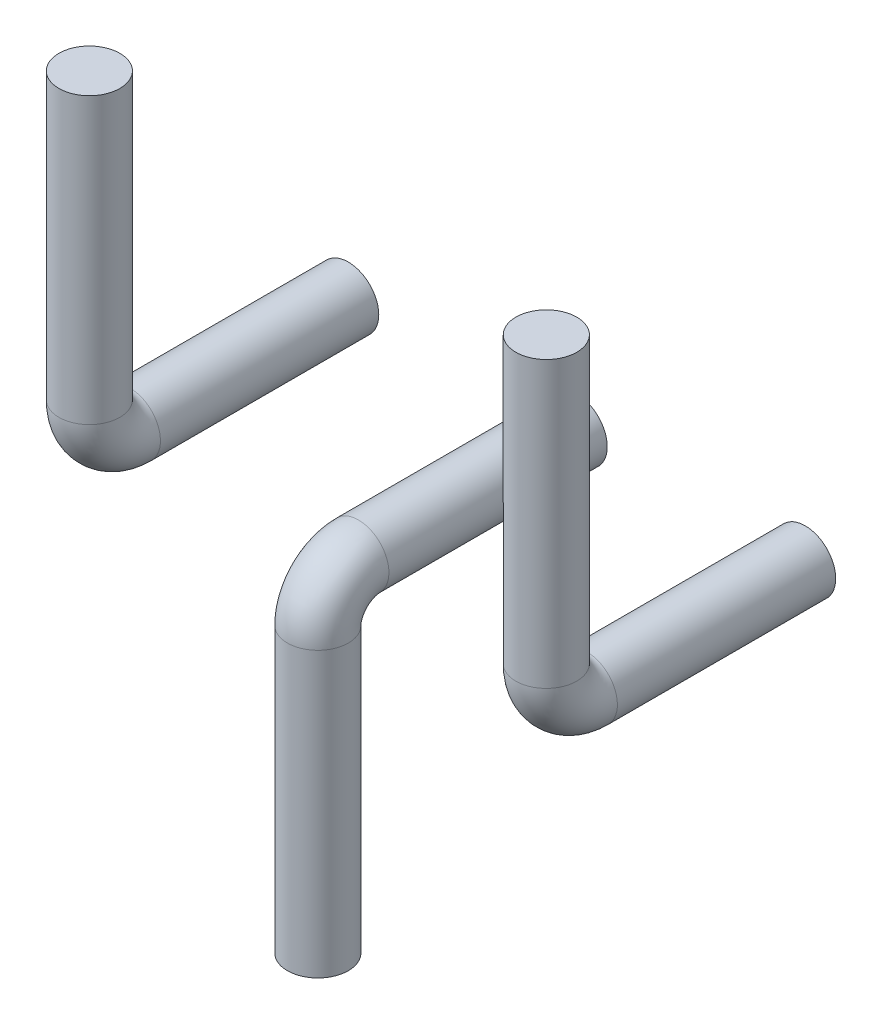
ISO-10303-21;
HEADER;
FILE_DESCRIPTION(('STEP AP214'),'2;1');
FILE_NAME('part.step','',(''),(''),'','','');
FILE_SCHEMA(('AUTOMOTIVE_DESIGN { 1 0 10303 214 1 1 1 1 }'));
ENDSEC;
DATA;
#1=APPLICATION_CONTEXT('core data for automotive mechanical design processes');
#2=APPLICATION_PROTOCOL_DEFINITION('international standard','automotive_design',2000,#1);
#3=PRODUCT_CONTEXT('',#1,'mechanical');
#4=PRODUCT('Part','Part','',(#3));
#5=PRODUCT_RELATED_PRODUCT_CATEGORY('part','',(#4));
#6=PRODUCT_DEFINITION_FORMATION('','',#4);
#7=PRODUCT_DEFINITION_CONTEXT('part definition',#1,'design');
#8=PRODUCT_DEFINITION('design','',#6,#7);
#9=PRODUCT_DEFINITION_SHAPE('','',#8);
#10=(LENGTH_UNIT() NAMED_UNIT(*) SI_UNIT(.MILLI.,.METRE.));
#11=(NAMED_UNIT(*) PLANE_ANGLE_UNIT() SI_UNIT($,.RADIAN.));
#12=(NAMED_UNIT(*) SI_UNIT($,.STERADIAN.) SOLID_ANGLE_UNIT());
#13=UNCERTAINTY_MEASURE_WITH_UNIT(LENGTH_MEASURE(1.E-05),#10,'distance_accuracy_value','');
#14=(GEOMETRIC_REPRESENTATION_CONTEXT(3) GLOBAL_UNCERTAINTY_ASSIGNED_CONTEXT((#13)) GLOBAL_UNIT_ASSIGNED_CONTEXT((#10,
#11,#12)) REPRESENTATION_CONTEXT('',''));
#15=CARTESIAN_POINT('',(0.,0.,0.));
#16=DIRECTION('',(0.,0.,1.));
#17=DIRECTION('',(1.,0.,0.));
#18=AXIS2_PLACEMENT_3D('',#15,#16,#17);
#19=CARTESIAN_POINT('',(-32.5000000000001,-32.,25.5));
#20=DIRECTION('',(0.,-1.,0.));
#21=DIRECTION('',(1.,0.,0.));
#22=AXIS2_PLACEMENT_3D('',#19,#20,#21);
#23=PLANE('',#22);
#24=CARTESIAN_POINT('',(-32.5000000000001,-32.,25.5));
#25=DIRECTION('',(0.,-1.,0.));
#26=DIRECTION('',(1.,0.,0.));
#27=AXIS2_PLACEMENT_3D('',#24,#25,#26);
#28=CIRCLE('',#27,3.);
#29=CARTESIAN_POINT('',(-29.5000000000001,-32.,25.5));
#30=VERTEX_POINT('',#29);
#31=EDGE_CURVE('E55',#30,#30,#28,.T.);
#32=ORIENTED_EDGE('',*,*,#31,.T.);
#33=EDGE_LOOP('',(#32));
#34=FACE_BOUND('',#33,.T.);
#35=ADVANCED_FACE('F41',(#34),#23,.T.);
#36=CARTESIAN_POINT('',(-32.5000000000001,-0.0508158360944468,0.));
#37=DIRECTION('',(0.,0.,1.));
#38=DIRECTION('',(1.,0.,0.));
#39=AXIS2_PLACEMENT_3D('',#36,#37,#38);
#40=PLANE('',#39);
#41=CARTESIAN_POINT('',(-32.5000000000001,-0.0508158360944468,0.));
#42=DIRECTION('',(0.,0.,1.));
#43=DIRECTION('',(1.,0.,0.));
#44=AXIS2_PLACEMENT_3D('',#41,#42,#43);
#45=CIRCLE('',#44,3.);
#46=CARTESIAN_POINT('',(-29.5000000000001,-0.0508158360944468,0.));
#47=VERTEX_POINT('',#46);
#48=EDGE_CURVE('E11',#47,#47,#45,.T.);
#49=ORIENTED_EDGE('',*,*,#48,.F.);
#50=EDGE_LOOP('',(#49));
#51=FACE_BOUND('',#50,.T.);
#52=ADVANCED_FACE('F65',(#51),#40,.F.);
#53=CARTESIAN_POINT('',(-32.5000000000001,-32.,25.5));
#54=DIRECTION('',(0.,1.,0.));
#55=DIRECTION('',(0.,0.,1.));
#56=AXIS2_PLACEMENT_3D('',#53,#54,#55);
#57=CYLINDRICAL_SURFACE('',#56,3.);
#58=CARTESIAN_POINT('',(-32.5000000000001,-4.05081583609447,25.5));
#59=DIRECTION('',(0.,-1.,0.));
#60=DIRECTION('',(1.,0.,0.));
#61=AXIS2_PLACEMENT_3D('',#58,#59,#60);
#62=CIRCLE('',#61,3.);
#63=CARTESIAN_POINT('',(-32.5000000000001,-4.0508158360945,28.5));
#64=VERTEX_POINT('',#63);
#65=EDGE_CURVE('E51',#64,#64,#62,.T.);
#66=ORIENTED_EDGE('',*,*,#65,.T.);
#67=EDGE_LOOP('',(#66));
#68=FACE_BOUND('',#67,.T.);
#69=ORIENTED_EDGE('',*,*,#31,.F.);
#70=EDGE_LOOP('',(#69));
#71=FACE_BOUND('',#70,.T.);
#72=ADVANCED_FACE('F62',(#68,#71),#57,.T.);
#73=CARTESIAN_POINT('',(-32.5000000000001,-4.05081583609445,21.5));
#74=DIRECTION('',(-1.,0.,0.));
#75=DIRECTION('',(0.,0.,1.));
#76=AXIS2_PLACEMENT_3D('',#73,#74,#75);
#77=TOROIDAL_SURFACE('',#76,4.,3.);
#78=CARTESIAN_POINT('',(-32.5000000000001,-0.0508158360944463,21.5));
#79=DIRECTION('',(0.,0.,1.));
#80=DIRECTION('',(1.,0.,0.));
#81=AXIS2_PLACEMENT_3D('',#78,#79,#80);
#82=CIRCLE('',#81,3.);
#83=CARTESIAN_POINT('',(-32.5000000000001,2.94918416390555,21.5));
#84=VERTEX_POINT('',#83);
#85=EDGE_CURVE('E47',#84,#84,#82,.T.);
#86=CARTESIAN_POINT('',(-32.5000000000001,-4.05081583609445,21.5));
#87=DIRECTION('',(-1.,0.,0.));
#88=DIRECTION('',(0.,0.,1.));
#89=AXIS2_PLACEMENT_3D('',#86,#87,#88);
#90=CIRCLE('',#89,7.);
#91=EDGE_CURVE('',#64,#84,#90,.T.);
#92=ORIENTED_EDGE('',*,*,#65,.F.);
#93=ORIENTED_EDGE('',*,*,#85,.T.);
#94=ORIENTED_EDGE('',*,*,#91,.T.);
#95=ORIENTED_EDGE('',*,*,#91,.F.);
#96=EDGE_LOOP('',(#92,#94,#93,#95));
#97=FACE_BOUND('',#96,.T.);
#98=ADVANCED_FACE('F64',(#97),#77,.T.);
#99=CARTESIAN_POINT('',(-32.5000000000001,-0.0508158360944468,21.5));
#100=DIRECTION('',(0.,0.,-1.));
#101=DIRECTION('',(-1.,0.,0.));
#102=AXIS2_PLACEMENT_3D('',#99,#100,#101);
#103=CYLINDRICAL_SURFACE('',#102,3.);
#104=ORIENTED_EDGE('',*,*,#48,.T.);
#105=EDGE_LOOP('',(#104));
#106=FACE_BOUND('',#105,.T.);
#107=ORIENTED_EDGE('',*,*,#85,.F.);
#108=EDGE_LOOP('',(#107));
#109=FACE_BOUND('',#108,.T.);
#110=ADVANCED_FACE('F72',(#106,#109),#103,.T.);
#111=CLOSED_SHELL('',(#35,#52,#72,#98,#110));
#112=MANIFOLD_SOLID_BREP('B2',#111);
#113=CARTESIAN_POINT('',(-55.0000000000002,31.9999999999999,25.5));
#114=DIRECTION('',(0.,1.,0.));
#115=DIRECTION('',(1.,0.,0.));
#116=AXIS2_PLACEMENT_3D('',#113,#114,#115);
#117=PLANE('',#116);
#118=CARTESIAN_POINT('',(-55.0000000000002,31.9999999999999,25.5));
#119=DIRECTION('',(0.,1.,0.));
#120=DIRECTION('',(1.,0.,0.));
#121=AXIS2_PLACEMENT_3D('',#118,#119,#120);
#122=CIRCLE('',#121,3.);
#123=CARTESIAN_POINT('',(-52.0000000000002,31.9999999999999,25.5));
#124=VERTEX_POINT('',#123);
#125=EDGE_CURVE('E132',#124,#124,#122,.T.);
#126=ORIENTED_EDGE('',*,*,#125,.T.);
#127=EDGE_LOOP('',(#126));
#128=FACE_BOUND('',#127,.T.);
#129=ADVANCED_FACE('F118',(#128),#117,.T.);
#130=CARTESIAN_POINT('',(-55.0000000000002,-0.0508158360944468,0.));
#131=DIRECTION('',(0.,0.,1.));
#132=DIRECTION('',(1.,0.,0.));
#133=AXIS2_PLACEMENT_3D('',#130,#131,#132);
#134=PLANE('',#133);
#135=CARTESIAN_POINT('',(-55.0000000000002,-0.0508158360944468,0.));
#136=DIRECTION('',(0.,0.,1.));
#137=DIRECTION('',(1.,0.,0.));
#138=AXIS2_PLACEMENT_3D('',#135,#136,#137);
#139=CIRCLE('',#138,3.);
#140=CARTESIAN_POINT('',(-52.0000000000002,-0.0508158360944468,0.));
#141=VERTEX_POINT('',#140);
#142=EDGE_CURVE('E40',#141,#141,#139,.T.);
#143=ORIENTED_EDGE('',*,*,#142,.F.);
#144=EDGE_LOOP('',(#143));
#145=FACE_BOUND('',#144,.T.);
#146=ADVANCED_FACE('F142',(#145),#134,.F.);
#147=CARTESIAN_POINT('',(-55.0000000000002,31.9999999999999,25.5));
#148=DIRECTION('',(0.,-1.,0.));
#149=DIRECTION('',(0.,0.,-1.));
#150=AXIS2_PLACEMENT_3D('',#147,#148,#149);
#151=CYLINDRICAL_SURFACE('',#150,3.);
#152=CARTESIAN_POINT('',(-55.0000000000002,3.94918416390558,25.5));
#153=DIRECTION('',(0.,1.,0.));
#154=DIRECTION('',(1.,0.,0.));
#155=AXIS2_PLACEMENT_3D('',#152,#153,#154);
#156=CIRCLE('',#155,3.);
#157=CARTESIAN_POINT('',(-55.0000000000002,3.9491841639056,28.5));
#158=VERTEX_POINT('',#157);
#159=EDGE_CURVE('E128',#158,#158,#156,.T.);
#160=ORIENTED_EDGE('',*,*,#159,.T.);
#161=EDGE_LOOP('',(#160));
#162=FACE_BOUND('',#161,.T.);
#163=ORIENTED_EDGE('',*,*,#125,.F.);
#164=EDGE_LOOP('',(#163));
#165=FACE_BOUND('',#164,.T.);
#166=ADVANCED_FACE('F139',(#162,#165),#151,.T.);
#167=CARTESIAN_POINT('',(-55.0000000000002,3.94918416390555,21.5));
#168=DIRECTION('',(1.,0.,0.));
#169=DIRECTION('',(0.,0.,-1.));
#170=AXIS2_PLACEMENT_3D('',#167,#168,#169);
#171=TOROIDAL_SURFACE('',#170,4.,3.);
#172=CARTESIAN_POINT('',(-55.0000000000002,-0.0508158360944472,21.5));
#173=DIRECTION('',(0.,0.,1.));
#174=DIRECTION('',(1.,0.,0.));
#175=AXIS2_PLACEMENT_3D('',#172,#173,#174);
#176=CIRCLE('',#175,3.);
#177=CARTESIAN_POINT('',(-55.0000000000002,-3.05081583609445,21.5));
#178=VERTEX_POINT('',#177);
#179=EDGE_CURVE('E124',#178,#178,#176,.T.);
#180=CARTESIAN_POINT('',(-55.0000000000002,3.94918416390555,21.5));
#181=DIRECTION('',(1.,0.,0.));
#182=DIRECTION('',(0.,0.,-1.));
#183=AXIS2_PLACEMENT_3D('',#180,#181,#182);
#184=CIRCLE('',#183,7.);
#185=EDGE_CURVE('',#158,#178,#184,.T.);
#186=ORIENTED_EDGE('',*,*,#159,.F.);
#187=ORIENTED_EDGE('',*,*,#179,.T.);
#188=ORIENTED_EDGE('',*,*,#185,.T.);
#189=ORIENTED_EDGE('',*,*,#185,.F.);
#190=EDGE_LOOP('',(#186,#188,#187,#189));
#191=FACE_BOUND('',#190,.T.);
#192=ADVANCED_FACE('F141',(#191),#171,.T.);
#193=CARTESIAN_POINT('',(-55.0000000000002,-0.0508158360944468,21.5));
#194=DIRECTION('',(0.,0.,-1.));
#195=DIRECTION('',(-1.,0.,0.));
#196=AXIS2_PLACEMENT_3D('',#193,#194,#195);
#197=CYLINDRICAL_SURFACE('',#196,3.);
#198=ORIENTED_EDGE('',*,*,#142,.T.);
#199=EDGE_LOOP('',(#198));
#200=FACE_BOUND('',#199,.T.);
#201=ORIENTED_EDGE('',*,*,#179,.F.);
#202=EDGE_LOOP('',(#201));
#203=FACE_BOUND('',#202,.T.);
#204=ADVANCED_FACE('F149',(#200,#203),#197,.T.);
#205=CLOSED_SHELL('',(#129,#146,#166,#192,#204));
#206=MANIFOLD_SOLID_BREP('B6',#205);
#207=CARTESIAN_POINT('',(-10.0000000000002,31.9999999999999,25.5));
#208=DIRECTION('',(0.,1.,0.));
#209=DIRECTION('',(1.,0.,0.));
#210=AXIS2_PLACEMENT_3D('',#207,#208,#209);
#211=PLANE('',#210);
#212=CARTESIAN_POINT('',(-10.0000000000002,31.9999999999999,25.5));
#213=DIRECTION('',(0.,1.,0.));
#214=DIRECTION('',(1.,0.,0.));
#215=AXIS2_PLACEMENT_3D('',#212,#213,#214);
#216=CIRCLE('',#215,3.);
#217=CARTESIAN_POINT('',(-7.00000000000018,31.9999999999999,25.5));
#218=VERTEX_POINT('',#217);
#219=EDGE_CURVE('E202',#218,#218,#216,.T.);
#220=ORIENTED_EDGE('',*,*,#219,.T.);
#221=EDGE_LOOP('',(#220));
#222=FACE_BOUND('',#221,.T.);
#223=ADVANCED_FACE('F188',(#222),#211,.T.);
#224=CARTESIAN_POINT('',(-10.0000000000002,-0.0508158360944468,0.));
#225=DIRECTION('',(0.,0.,1.));
#226=DIRECTION('',(1.,0.,0.));
#227=AXIS2_PLACEMENT_3D('',#224,#225,#226);
#228=PLANE('',#227);
#229=CARTESIAN_POINT('',(-10.0000000000002,-0.0508158360944468,0.));
#230=DIRECTION('',(0.,0.,1.));
#231=DIRECTION('',(1.,0.,0.));
#232=AXIS2_PLACEMENT_3D('',#229,#230,#231);
#233=CIRCLE('',#232,3.);
#234=CARTESIAN_POINT('',(-7.00000000000018,-0.0508158360944468,0.));
#235=VERTEX_POINT('',#234);
#236=EDGE_CURVE('E117',#235,#235,#233,.T.);
#237=ORIENTED_EDGE('',*,*,#236,.F.);
#238=EDGE_LOOP('',(#237));
#239=FACE_BOUND('',#238,.T.);
#240=ADVANCED_FACE('F212',(#239),#228,.F.);
#241=CARTESIAN_POINT('',(-10.0000000000002,31.9999999999999,25.5));
#242=DIRECTION('',(0.,-1.,0.));
#243=DIRECTION('',(0.,0.,-1.));
#244=AXIS2_PLACEMENT_3D('',#241,#242,#243);
#245=CYLINDRICAL_SURFACE('',#244,3.);
#246=CARTESIAN_POINT('',(-10.0000000000002,3.94918416390558,25.5));
#247=DIRECTION('',(0.,1.,0.));
#248=DIRECTION('',(1.,0.,0.));
#249=AXIS2_PLACEMENT_3D('',#246,#247,#248);
#250=CIRCLE('',#249,3.);
#251=CARTESIAN_POINT('',(-10.0000000000002,3.9491841639056,28.5));
#252=VERTEX_POINT('',#251);
#253=EDGE_CURVE('E198',#252,#252,#250,.T.);
#254=ORIENTED_EDGE('',*,*,#253,.T.);
#255=EDGE_LOOP('',(#254));
#256=FACE_BOUND('',#255,.T.);
#257=ORIENTED_EDGE('',*,*,#219,.F.);
#258=EDGE_LOOP('',(#257));
#259=FACE_BOUND('',#258,.T.);
#260=ADVANCED_FACE('F209',(#256,#259),#245,.T.);
#261=CARTESIAN_POINT('',(-10.0000000000002,3.94918416390555,21.5));
#262=DIRECTION('',(1.,0.,0.));
#263=DIRECTION('',(0.,0.,-1.));
#264=AXIS2_PLACEMENT_3D('',#261,#262,#263);
#265=TOROIDAL_SURFACE('',#264,4.,3.);
#266=CARTESIAN_POINT('',(-10.0000000000002,-0.0508158360944472,21.5));
#267=DIRECTION('',(0.,0.,1.));
#268=DIRECTION('',(1.,0.,0.));
#269=AXIS2_PLACEMENT_3D('',#266,#267,#268);
#270=CIRCLE('',#269,3.);
#271=CARTESIAN_POINT('',(-10.0000000000002,-3.05081583609445,21.5));
#272=VERTEX_POINT('',#271);
#273=EDGE_CURVE('E194',#272,#272,#270,.T.);
#274=CARTESIAN_POINT('',(-10.0000000000002,3.94918416390555,21.5));
#275=DIRECTION('',(1.,0.,0.));
#276=DIRECTION('',(0.,0.,-1.));
#277=AXIS2_PLACEMENT_3D('',#274,#275,#276);
#278=CIRCLE('',#277,7.);
#279=EDGE_CURVE('',#252,#272,#278,.T.);
#280=ORIENTED_EDGE('',*,*,#253,.F.);
#281=ORIENTED_EDGE('',*,*,#273,.T.);
#282=ORIENTED_EDGE('',*,*,#279,.T.);
#283=ORIENTED_EDGE('',*,*,#279,.F.);
#284=EDGE_LOOP('',(#280,#282,#281,#283));
#285=FACE_BOUND('',#284,.T.);
#286=ADVANCED_FACE('F211',(#285),#265,.T.);
#287=CARTESIAN_POINT('',(-10.0000000000002,-0.0508158360944468,21.5));
#288=DIRECTION('',(0.,0.,-1.));
#289=DIRECTION('',(-1.,0.,0.));
#290=AXIS2_PLACEMENT_3D('',#287,#288,#289);
#291=CYLINDRICAL_SURFACE('',#290,3.);
#292=ORIENTED_EDGE('',*,*,#236,.T.);
#293=EDGE_LOOP('',(#292));
#294=FACE_BOUND('',#293,.T.);
#295=ORIENTED_EDGE('',*,*,#273,.F.);
#296=EDGE_LOOP('',(#295));
#297=FACE_BOUND('',#296,.T.);
#298=ADVANCED_FACE('F219',(#294,#297),#291,.T.);
#299=CLOSED_SHELL('',(#223,#240,#260,#286,#298));
#300=MANIFOLD_SOLID_BREP('B35',#299);
#301=ADVANCED_BREP_SHAPE_REPRESENTATION('',(#18,#112,#206,#300),#14);
#302=SHAPE_DEFINITION_REPRESENTATION(#9,#301);
ENDSEC;
END-ISO-10303-21;
